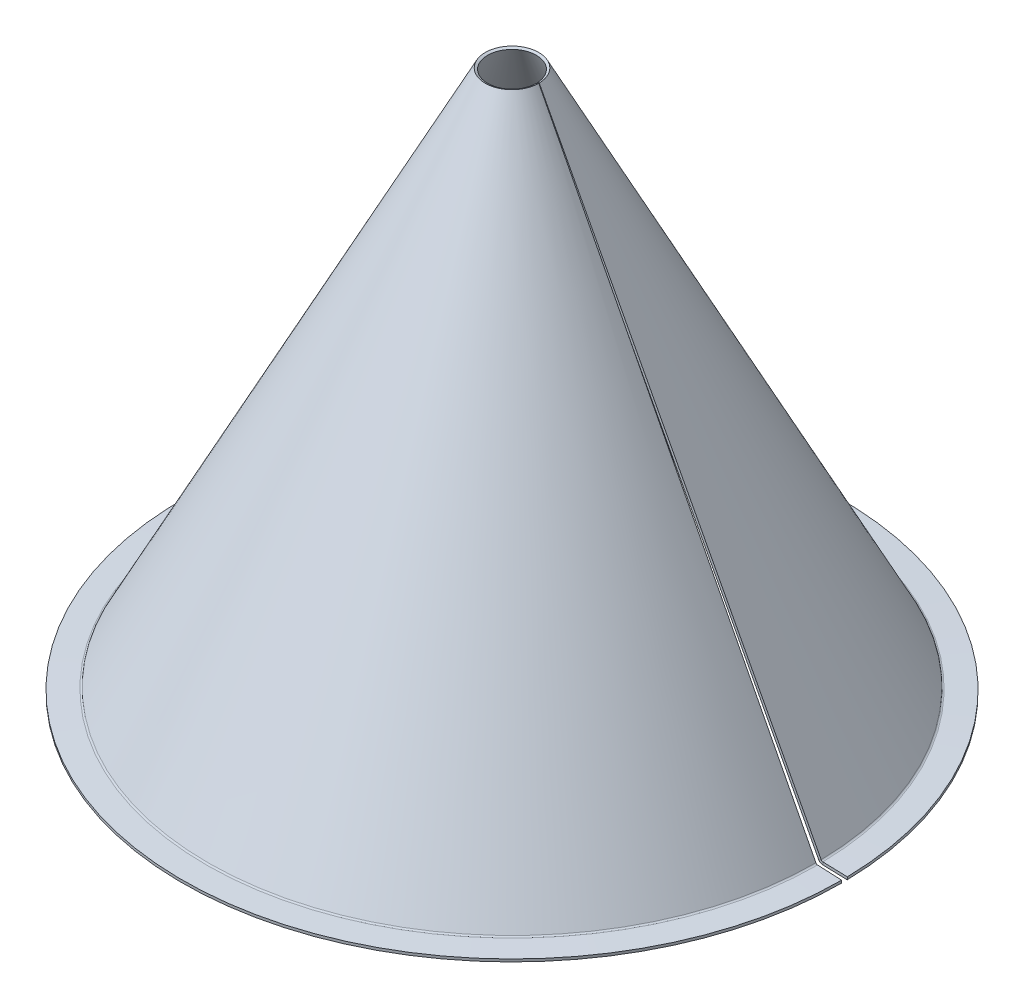
ISO-10303-21;
HEADER;
FILE_DESCRIPTION(('STEP AP214'),'2;1');
FILE_NAME('part.step','',(''),(''),'','','');
FILE_SCHEMA(('AUTOMOTIVE_DESIGN { 1 0 10303 214 1 1 1 1 }'));
ENDSEC;
DATA;
#1=APPLICATION_CONTEXT('core data for automotive mechanical design processes');
#2=APPLICATION_PROTOCOL_DEFINITION('international standard','automotive_design',2000,#1);
#3=PRODUCT_CONTEXT('',#1,'mechanical');
#4=PRODUCT('Part','Part','',(#3));
#5=PRODUCT_RELATED_PRODUCT_CATEGORY('part','',(#4));
#6=PRODUCT_DEFINITION_FORMATION('','',#4);
#7=PRODUCT_DEFINITION_CONTEXT('part definition',#1,'design');
#8=PRODUCT_DEFINITION('design','',#6,#7);
#9=PRODUCT_DEFINITION_SHAPE('','',#8);
#10=(LENGTH_UNIT() NAMED_UNIT(*) SI_UNIT(.MILLI.,.METRE.));
#11=(NAMED_UNIT(*) PLANE_ANGLE_UNIT() SI_UNIT($,.RADIAN.));
#12=(NAMED_UNIT(*) SI_UNIT($,.STERADIAN.) SOLID_ANGLE_UNIT());
#13=UNCERTAINTY_MEASURE_WITH_UNIT(LENGTH_MEASURE(1.E-05),#10,'distance_accuracy_value','');
#14=(GEOMETRIC_REPRESENTATION_CONTEXT(3) GLOBAL_UNCERTAINTY_ASSIGNED_CONTEXT((#13)) GLOBAL_UNIT_ASSIGNED_CONTEXT((#10,
#11,#12)) REPRESENTATION_CONTEXT('',''));
#15=CARTESIAN_POINT('',(0.,0.,0.));
#16=DIRECTION('',(0.,0.,1.));
#17=DIRECTION('',(1.,0.,0.));
#18=AXIS2_PLACEMENT_3D('',#15,#16,#17);
#19=CARTESIAN_POINT('',(113.891435474491,-110.702963726538,-1.98798240097352));
#20=DIRECTION('',(-0.0174524064372693,0.,-0.999847695156392));
#21=DIRECTION('',(-0.458902735960843,0.888450401536996,0.00801017705192669));
#22=AXIS2_PLACEMENT_3D('',#19,#20,#21);
#23=PLANE('',#22);
#24=DIRECTION('',(0.458902735960843,-0.888450401536996,-0.00801017705192672));
#25=VECTOR('',#24,1.);
#26=CARTESIAN_POINT('',(208.990472015823,-295.907135304541,-3.64794225841208));
#27=LINE('',#26,#25);
#28=CARTESIAN_POINT('',(112.722222279573,-109.528719071404,-1.96757370874133));
#29=VERTEX_POINT('',#28);
#30=CARTESIAN_POINT('',(9.11016186532634,91.0675499536033,-0.159018466865714));
#31=VERTEX_POINT('',#30);
#32=EDGE_CURVE('E233',#29,#31,#27,.F.);
#33=ORIENTED_EDGE('',*,*,#32,.F.);
#34=DIRECTION('',(-0.888315086237538,-0.458972639716953,0.0155055975069794));
#35=VECTOR('',#34,1.);
#36=CARTESIAN_POINT('',(113.610537365811,-109.069746431687,-1.98307930624834));
#37=LINE('',#36,#35);
#38=CARTESIAN_POINT('',(113.610537365811,-109.069746431687,-1.98307930624836));
#39=VERTEX_POINT('',#38);
#40=EDGE_CURVE('E220',#39,#29,#37,.T.);
#41=ORIENTED_EDGE('',*,*,#40,.F.);
#42=DIRECTION('',(0.458902735960843,-0.888450401536996,-0.00801017705192672));
#43=VECTOR('',#42,1.);
#44=CARTESIAN_POINT('',(209.878787102061,-295.448162664824,-3.66344785591906));
#45=LINE('',#44,#43);
#46=CARTESIAN_POINT('',(9.99847695156389,91.5265225933203,-0.174524064372693));
#47=VERTEX_POINT('',#46);
#48=EDGE_CURVE('E226',#39,#47,#45,.F.);
#49=ORIENTED_EDGE('',*,*,#48,.T.);
#50=DIRECTION('',(-0.888315086237536,-0.458972639716955,0.0155055975069789));
#51=VECTOR('',#50,1.);
#52=CARTESIAN_POINT('',(9.55431940844513,91.2970362734618,-0.166771265619205));
#53=LINE('',#52,#51);
#54=EDGE_CURVE('E14',#47,#31,#53,.T.);
#55=ORIENTED_EDGE('',*,*,#54,.T.);
#56=EDGE_LOOP('',(#33,#41,#49,#55));
#57=FACE_BOUND('',#56,.T.);
#58=ADVANCED_FACE('F78',(#57),#23,.F.);
#59=CARTESIAN_POINT('',(9.55577479923137,91.2970362734621,-1.44872670562888E-13));
#60=DIRECTION('',(0.,0.,1.));
#61=DIRECTION('',(0.458972639716955,-0.888450401536996,0.));
#62=AXIS2_PLACEMENT_3D('',#59,#60,#61);
#63=PLANE('',#62);
#64=DIRECTION('',(0.458972639716955,-0.888450401536996,0.));
#65=VECTOR('',#64,1.);
#66=CARTESIAN_POINT('',(209.910757527158,-295.448162664824,-2.4831595417711E-12));
#67=LINE('',#66,#65);
#68=CARTESIAN_POINT('',(9.99999999999998,91.5265225933203,-1.1829596400984E-13));
#69=VERTEX_POINT('',#68);
#70=CARTESIAN_POINT('',(113.627843436735,-109.069746431687,-1.34417152777077E-12));
#71=VERTEX_POINT('',#70);
#72=EDGE_CURVE('E236',#69,#71,#67,.T.);
#73=ORIENTED_EDGE('',*,*,#72,.T.);
#74=DIRECTION('',(-0.888450401536998,-0.458972639716952,0.));
#75=VECTOR('',#74,1.);
#76=CARTESIAN_POINT('',(113.627843436735,-109.069746431687,-1.34417152777077E-12));
#77=LINE('',#76,#75);
#78=CARTESIAN_POINT('',(112.739393035198,-109.528719071404,-1.3336615180983E-12));
#79=VERTEX_POINT('',#78);
#80=EDGE_CURVE('E216',#71,#79,#77,.T.);
#81=ORIENTED_EDGE('',*,*,#80,.T.);
#82=DIRECTION('',(0.458972639716955,-0.888450401536996,0.));
#83=VECTOR('',#82,1.);
#84=CARTESIAN_POINT('',(209.022307125621,-295.907135304541,-2.47264953209862E-12));
#85=LINE('',#84,#83);
#86=CARTESIAN_POINT('',(9.11154959846297,91.0675499536033,-1.07785954337365E-13));
#87=VERTEX_POINT('',#86);
#88=EDGE_CURVE('E232',#87,#79,#85,.T.);
#89=ORIENTED_EDGE('',*,*,#88,.F.);
#90=DIRECTION('',(-0.888450401536996,-0.458972639716955,0.));
#91=VECTOR('',#90,1.);
#92=CARTESIAN_POINT('',(9.55577479923144,91.2970362734621,-1.43697837872612E-13));
#93=LINE('',#92,#91);
#94=EDGE_CURVE('E82',#69,#87,#93,.T.);
#95=ORIENTED_EDGE('',*,*,#94,.F.);
#96=EDGE_LOOP('',(#73,#81,#89,#95));
#97=FACE_BOUND('',#96,.T.);
#98=ADVANCED_FACE('F80',(#97),#63,.F.);
#99=CARTESIAN_POINT('',(0.,-295.907135304541,0.));
#100=DIRECTION('',(0.,-1.,0.));
#101=DIRECTION('',(0.,0.,-1.));
#102=AXIS2_PLACEMENT_3D('',#99,#100,#101);
#103=CONICAL_SURFACE('',#102,209.022307125621,0.476838501925728);
#104=ORIENTED_EDGE('',*,*,#88,.T.);
#105=CARTESIAN_POINT('',(0.,-109.528719071404,0.));
#106=DIRECTION('',(0.,-1.,0.));
#107=DIRECTION('',(0.,0.,-1.));
#108=AXIS2_PLACEMENT_3D('',#105,#106,#107);
#109=CIRCLE('',#108,112.739393035198);
#110=EDGE_CURVE('E94',#79,#29,#109,.T.);
#111=ORIENTED_EDGE('',*,*,#110,.T.);
#112=ORIENTED_EDGE('',*,*,#32,.T.);
#113=CARTESIAN_POINT('',(0.,91.0675499536033,0.));
#114=DIRECTION('',(0.,-1.,0.));
#115=DIRECTION('',(0.,0.,-1.));
#116=AXIS2_PLACEMENT_3D('',#113,#114,#115);
#117=CIRCLE('',#116,9.111549598463);
#118=EDGE_CURVE('E228',#31,#87,#117,.F.);
#119=ORIENTED_EDGE('',*,*,#118,.T.);
#120=EDGE_LOOP('',(#104,#111,#112,#119));
#121=FACE_BOUND('',#120,.T.);
#122=ADVANCED_FACE('F298',(#121),#103,.F.);
#123=CARTESIAN_POINT('',(0.,-295.448162664824,0.));
#124=DIRECTION('',(0.,-1.,0.));
#125=DIRECTION('',(0.,0.,-1.));
#126=AXIS2_PLACEMENT_3D('',#123,#124,#125);
#127=CONICAL_SURFACE('',#126,209.910757527158,0.476838501925728);
#128=CARTESIAN_POINT('',(0.,-109.069746431687,0.));
#129=DIRECTION('',(0.,-1.,0.));
#130=DIRECTION('',(1.,0.,0.));
#131=AXIS2_PLACEMENT_3D('',#128,#129,#130);
#132=CIRCLE('',#131,113.627843436735);
#133=EDGE_CURVE('E102',#71,#39,#132,.T.);
#134=ORIENTED_EDGE('',*,*,#133,.F.);
#135=ORIENTED_EDGE('',*,*,#72,.F.);
#136=CARTESIAN_POINT('',(0.,91.5265225933203,0.));
#137=DIRECTION('',(0.,-1.,0.));
#138=DIRECTION('',(0.,0.,-1.));
#139=AXIS2_PLACEMENT_3D('',#136,#137,#138);
#140=CIRCLE('',#139,10.);
#141=EDGE_CURVE('E239',#47,#69,#140,.F.);
#142=ORIENTED_EDGE('',*,*,#141,.F.);
#143=ORIENTED_EDGE('',*,*,#48,.F.);
#144=EDGE_LOOP('',(#134,#135,#142,#143));
#145=FACE_BOUND('',#144,.T.);
#146=ADVANCED_FACE('F303',(#145),#127,.T.);
#147=CARTESIAN_POINT('',(0.,91.2970362734618,0.));
#148=DIRECTION('',(0.,1.,0.));
#149=DIRECTION('',(0.,0.,1.));
#150=AXIS2_PLACEMENT_3D('',#147,#148,#149);
#151=CONICAL_SURFACE('',#150,9.55577479923144,1.09395782486917);
#152=ORIENTED_EDGE('',*,*,#54,.F.);
#153=ORIENTED_EDGE('',*,*,#141,.T.);
#154=ORIENTED_EDGE('',*,*,#94,.T.);
#155=ORIENTED_EDGE('',*,*,#118,.F.);
#156=EDGE_LOOP('',(#152,#153,#154,#155));
#157=FACE_BOUND('',#156,.T.);
#158=ADVANCED_FACE('F300',(#157),#151,.F.);
#159=CARTESIAN_POINT('',(114.264870258333,-108.731667185271,-1.99450072937193));
#160=DIRECTION('',(0.0174524064372692,0.,0.999847695156391));
#161=DIRECTION('',(0.999847695156391,0.,-0.0174524064372692));
#162=AXIS2_PLACEMENT_3D('',#159,#160,#161);
#163=PLANE('',#162);
#164=DIRECTION('',(-0.0467361159105008,-0.998906937592001,0.000815781937710077));
#165=VECTOR('',#164,1.);
#166=CARTESIAN_POINT('',(114.230444435354,-109.467462035502,-1.99389982439666));
#167=LINE('',#166,#165);
#168=CARTESIAN_POINT('',(114.230444435354,-109.467462035502,-1.99389982439666));
#169=VERTEX_POINT('',#168);
#170=CARTESIAN_POINT('',(114.183708319443,-110.466368973094,-1.99308404245895));
#171=VERTEX_POINT('',#170);
#172=EDGE_CURVE('E224',#169,#171,#167,.T.);
#173=ORIENTED_EDGE('',*,*,#172,.F.);
#174=CARTESIAN_POINT('',(114.264870258333,-108.731667185271,-1.99450072937193));
#175=DIRECTION('',(-0.0174524064372692,0.,-0.999847695156391));
#176=DIRECTION('',(-0.999847695156392,0.,0.0174524064372692));
#177=AXIS2_PLACEMENT_3D('',#174,#175,#176);
#178=CIRCLE('',#177,0.7366);
#179=EDGE_CURVE('E196',#39,#169,#178,.F.);
#180=ORIENTED_EDGE('',*,*,#179,.F.);
#181=ORIENTED_EDGE('',*,*,#40,.T.);
#182=CARTESIAN_POINT('',(114.264870258333,-108.731667185271,-1.99450072937192));
#183=DIRECTION('',(-0.0174524064372692,0.,-0.999847695156391));
#184=DIRECTION('',(-0.999847695156391,0.,0.0174524064372692));
#185=AXIS2_PLACEMENT_3D('',#182,#183,#184);
#186=CIRCLE('',#185,1.73660000000001);
#187=EDGE_CURVE('E188',#29,#171,#186,.F.);
#188=ORIENTED_EDGE('',*,*,#187,.T.);
#189=EDGE_LOOP('',(#173,#180,#181,#188));
#190=FACE_BOUND('',#189,.T.);
#191=ADVANCED_FACE('F266',(#190),#163,.T.);
#192=CARTESIAN_POINT('',(114.282276002507,-108.731667185271,-1.35191320089552E-12));
#193=DIRECTION('',(0.,0.,1.));
#194=DIRECTION('',(1.,0.,0.));
#195=AXIS2_PLACEMENT_3D('',#192,#193,#194);
#196=PLANE('',#195);
#197=ORIENTED_EDGE('',*,*,#80,.F.);
#198=CARTESIAN_POINT('',(114.282276002507,-108.731667185271,-1.35191320089552E-12));
#199=DIRECTION('',(0.,0.,-1.));
#200=DIRECTION('',(-1.,0.,0.));
#201=AXIS2_PLACEMENT_3D('',#198,#199,#200);
#202=CIRCLE('',#201,0.7366);
#203=CARTESIAN_POINT('',(114.247844935509,-109.467462035502,-1.35150589526928E-12));
#204=VERTEX_POINT('',#203);
#205=EDGE_CURVE('E192',#71,#204,#202,.F.);
#206=ORIENTED_EDGE('',*,*,#205,.T.);
#207=DIRECTION('',(-0.0467432351316122,-0.998906937592002,0.));
#208=VECTOR('',#207,1.);
#209=CARTESIAN_POINT('',(114.247844935509,-109.467462035502,-1.35150589526928E-12));
#210=LINE('',#209,#208);
#211=CARTESIAN_POINT('',(114.201101700377,-110.466368973094,-1.3509529416632E-12));
#212=VERTEX_POINT('',#211);
#213=EDGE_CURVE('E157',#204,#212,#210,.T.);
#214=ORIENTED_EDGE('',*,*,#213,.T.);
#215=CARTESIAN_POINT('',(114.282276002507,-108.731667185271,-1.35191320089552E-12));
#216=DIRECTION('',(0.,0.,-1.));
#217=DIRECTION('',(-1.,0.,0.));
#218=AXIS2_PLACEMENT_3D('',#215,#216,#217);
#219=CIRCLE('',#218,1.73660000000001);
#220=EDGE_CURVE('E168',#79,#212,#219,.F.);
#221=ORIENTED_EDGE('',*,*,#220,.F.);
#222=EDGE_LOOP('',(#197,#206,#214,#221));
#223=FACE_BOUND('',#222,.T.);
#224=ADVANCED_FACE('F254',(#223),#196,.F.);
#225=CARTESIAN_POINT('',(113.82303358066,-109.447583249702,-1.34648054839486E-12));
#226=DIRECTION('',(0.,0.,1.));
#227=DIRECTION('',(0.998906937592002,-0.0467432351316118,0.));
#228=AXIS2_PLACEMENT_3D('',#225,#226,#227);
#229=PLANE('',#228);
#230=ORIENTED_EDGE('',*,*,#213,.F.);
#231=DIRECTION('',(0.998906937592002,-0.0467432351316118,0.));
#232=VECTOR('',#231,1.);
#233=CARTESIAN_POINT('',(113.82303358066,-109.447583249702,-1.34648054839486E-12));
#234=LINE('',#233,#232);
#235=CARTESIAN_POINT('',(123.235383767266,-109.888028381632,-1.45782485228714E-12));
#236=VERTEX_POINT('',#235);
#237=EDGE_CURVE('E151',#204,#236,#234,.T.);
#238=ORIENTED_EDGE('',*,*,#237,.T.);
#239=DIRECTION('',(-0.0467432351316122,-0.998906937592002,0.));
#240=VECTOR('',#239,1.);
#241=CARTESIAN_POINT('',(123.235383767266,-109.888028381632,-1.45782485228714E-12));
#242=LINE('',#241,#240);
#243=CARTESIAN_POINT('',(123.188640532135,-110.886935319224,-1.45727189868105E-12));
#244=VERTEX_POINT('',#243);
#245=EDGE_CURVE('E145',#236,#244,#242,.T.);
#246=ORIENTED_EDGE('',*,*,#245,.T.);
#247=DIRECTION('',(0.998906937592002,-0.0467432351316122,0.));
#248=VECTOR('',#247,1.);
#249=CARTESIAN_POINT('',(114.201101700377,-110.466368973094,-1.3509529416632E-12));
#250=LINE('',#249,#248);
#251=EDGE_CURVE('E148',#212,#244,#250,.T.);
#252=ORIENTED_EDGE('',*,*,#251,.F.);
#253=EDGE_LOOP('',(#230,#238,#246,#252));
#254=FACE_BOUND('',#253,.T.);
#255=ADVANCED_FACE('F147',(#254),#229,.F.);
#256=CARTESIAN_POINT('',(0.,-109.888028381632,0.));
#257=DIRECTION('',(0.,1.,0.));
#258=DIRECTION('',(0.,0.,1.));
#259=AXIS2_PLACEMENT_3D('',#256,#257,#258);
#260=CONICAL_SURFACE('',#259,123.235383767266,0.0467602736725706);
#261=ORIENTED_EDGE('',*,*,#245,.F.);
#262=CARTESIAN_POINT('',(0.,-109.888028381632,0.));
#263=DIRECTION('',(0.,-1.,0.));
#264=DIRECTION('',(1.,0.,0.));
#265=AXIS2_PLACEMENT_3D('',#262,#263,#264);
#266=CIRCLE('',#265,123.235383767266);
#267=CARTESIAN_POINT('',(123.216614421414,-109.888028381632,-2.15075400495923));
#268=VERTEX_POINT('',#267);
#269=EDGE_CURVE('E185',#236,#268,#266,.T.);
#270=ORIENTED_EDGE('',*,*,#269,.T.);
#271=DIRECTION('',(-0.0467361159104957,-0.998906937592002,0.000815781937709757));
#272=VECTOR('',#271,1.);
#273=CARTESIAN_POINT('',(123.216614421414,-109.888028381632,-2.15075400495923));
#274=LINE('',#273,#272);
#275=CARTESIAN_POINT('',(123.169878305504,-110.886935319224,-2.14993822302146));
#276=VERTEX_POINT('',#275);
#277=EDGE_CURVE('E158',#268,#276,#274,.T.);
#278=ORIENTED_EDGE('',*,*,#277,.T.);
#279=CARTESIAN_POINT('',(0.,-110.886935319224,0.));
#280=DIRECTION('',(0.,-1.,0.));
#281=DIRECTION('',(0.,0.,-1.));
#282=AXIS2_PLACEMENT_3D('',#279,#280,#281);
#283=CIRCLE('',#282,123.188640532135);
#284=EDGE_CURVE('E164',#244,#276,#283,.T.);
#285=ORIENTED_EDGE('',*,*,#284,.F.);
#286=EDGE_LOOP('',(#261,#270,#278,#285));
#287=FACE_BOUND('',#286,.T.);
#288=ADVANCED_FACE('F170',(#287),#260,.T.);
#289=CARTESIAN_POINT('',(113.805697781332,-109.447583249702,-1.98648584397262));
#290=DIRECTION('',(0.0174524064372692,0.,0.999847695156391));
#291=DIRECTION('',(0.998754799227092,-0.0467432351316118,-0.0174333298678635));
#292=AXIS2_PLACEMENT_3D('',#289,#290,#291);
#293=PLANE('',#292);
#294=DIRECTION('',(0.998754799227092,-0.0467432351316118,-0.0174333298678635));
#295=VECTOR('',#294,1.);
#296=CARTESIAN_POINT('',(113.805697781332,-109.447583249702,-1.98648584397262));
#297=LINE('',#296,#295);
#298=EDGE_CURVE('E204',#169,#268,#297,.T.);
#299=ORIENTED_EDGE('',*,*,#298,.F.);
#300=ORIENTED_EDGE('',*,*,#172,.T.);
#301=DIRECTION('',(0.998754799227092,-0.0467432351316122,-0.0174333298678635));
#302=VECTOR('',#301,1.);
#303=CARTESIAN_POINT('',(114.183708319443,-110.466368973094,-1.9930840424589));
#304=LINE('',#303,#302);
#305=EDGE_CURVE('E173',#171,#276,#304,.T.);
#306=ORIENTED_EDGE('',*,*,#305,.T.);
#307=ORIENTED_EDGE('',*,*,#277,.F.);
#308=EDGE_LOOP('',(#299,#300,#306,#307));
#309=FACE_BOUND('',#308,.T.);
#310=ADVANCED_FACE('F263',(#309),#293,.T.);
#311=CARTESIAN_POINT('',(0.,-110.466368973094,0.));
#312=DIRECTION('',(0.,-1.,0.));
#313=DIRECTION('',(0.,0.,-1.));
#314=AXIS2_PLACEMENT_3D('',#311,#312,#313);
#315=CONICAL_SURFACE('',#314,114.201101700377,1.52403605312233);
#316=ORIENTED_EDGE('',*,*,#284,.T.);
#317=ORIENTED_EDGE('',*,*,#305,.F.);
#318=CARTESIAN_POINT('',(0.,-110.466368973094,0.));
#319=DIRECTION('',(0.,-1.,0.));
#320=DIRECTION('',(0.,0.,-1.));
#321=AXIS2_PLACEMENT_3D('',#318,#319,#320);
#322=CIRCLE('',#321,114.201101700377);
#323=EDGE_CURVE('E166',#212,#171,#322,.T.);
#324=ORIENTED_EDGE('',*,*,#323,.F.);
#325=ORIENTED_EDGE('',*,*,#251,.T.);
#326=EDGE_LOOP('',(#316,#317,#324,#325));
#327=FACE_BOUND('',#326,.T.);
#328=ADVANCED_FACE('F162',(#327),#315,.F.);
#329=CARTESIAN_POINT('',(0.,-108.731667185271,0.));
#330=DIRECTION('',(0.,-1.,0.));
#331=DIRECTION('',(0.,0.,-1.));
#332=AXIS2_PLACEMENT_3D('',#329,#330,#331);
#333=TOROIDAL_SURFACE('',#332,114.282276002507,1.73660000000001);
#334=ORIENTED_EDGE('',*,*,#323,.T.);
#335=ORIENTED_EDGE('',*,*,#187,.F.);
#336=ORIENTED_EDGE('',*,*,#110,.F.);
#337=ORIENTED_EDGE('',*,*,#220,.T.);
#338=EDGE_LOOP('',(#334,#335,#336,#337));
#339=FACE_BOUND('',#338,.T.);
#340=ADVANCED_FACE('F269',(#339),#333,.T.);
#341=CARTESIAN_POINT('',(0.,-109.467462035502,0.));
#342=DIRECTION('',(0.,-1.,0.));
#343=DIRECTION('',(0.,0.,-1.));
#344=AXIS2_PLACEMENT_3D('',#341,#342,#343);
#345=CONICAL_SURFACE('',#344,114.247844935509,1.52403605312233);
#346=ORIENTED_EDGE('',*,*,#269,.F.);
#347=ORIENTED_EDGE('',*,*,#237,.F.);
#348=CARTESIAN_POINT('',(0.,-109.467462035502,0.));
#349=DIRECTION('',(0.,-1.,0.));
#350=DIRECTION('',(1.,0.,0.));
#351=AXIS2_PLACEMENT_3D('',#348,#349,#350);
#352=CIRCLE('',#351,114.247844935509);
#353=EDGE_CURVE('E200',#204,#169,#352,.T.);
#354=ORIENTED_EDGE('',*,*,#353,.T.);
#355=ORIENTED_EDGE('',*,*,#298,.T.);
#356=EDGE_LOOP('',(#346,#347,#354,#355));
#357=FACE_BOUND('',#356,.T.);
#358=ADVANCED_FACE('F261',(#357),#345,.T.);
#359=CARTESIAN_POINT('',(0.,-108.731667185271,0.));
#360=DIRECTION('',(0.,-1.,0.));
#361=DIRECTION('',(0.,0.,-1.));
#362=AXIS2_PLACEMENT_3D('',#359,#360,#361);
#363=TOROIDAL_SURFACE('',#362,114.282276002507,0.7366);
#364=ORIENTED_EDGE('',*,*,#353,.F.);
#365=ORIENTED_EDGE('',*,*,#205,.F.);
#366=ORIENTED_EDGE('',*,*,#133,.T.);
#367=ORIENTED_EDGE('',*,*,#179,.T.);
#368=EDGE_LOOP('',(#364,#365,#366,#367));
#369=FACE_BOUND('',#368,.T.);
#370=ADVANCED_FACE('F257',(#369),#363,.F.);
#371=CLOSED_SHELL('',(#58,#98,#122,#146,#158,#191,#224,#255,#288,#310,#328,#340,#358,#370));
#372=MANIFOLD_SOLID_BREP('B2',#371);
#373=ADVANCED_BREP_SHAPE_REPRESENTATION('',(#18,#372),#14);
#374=SHAPE_DEFINITION_REPRESENTATION(#9,#373);
ENDSEC;
END-ISO-10303-21;
